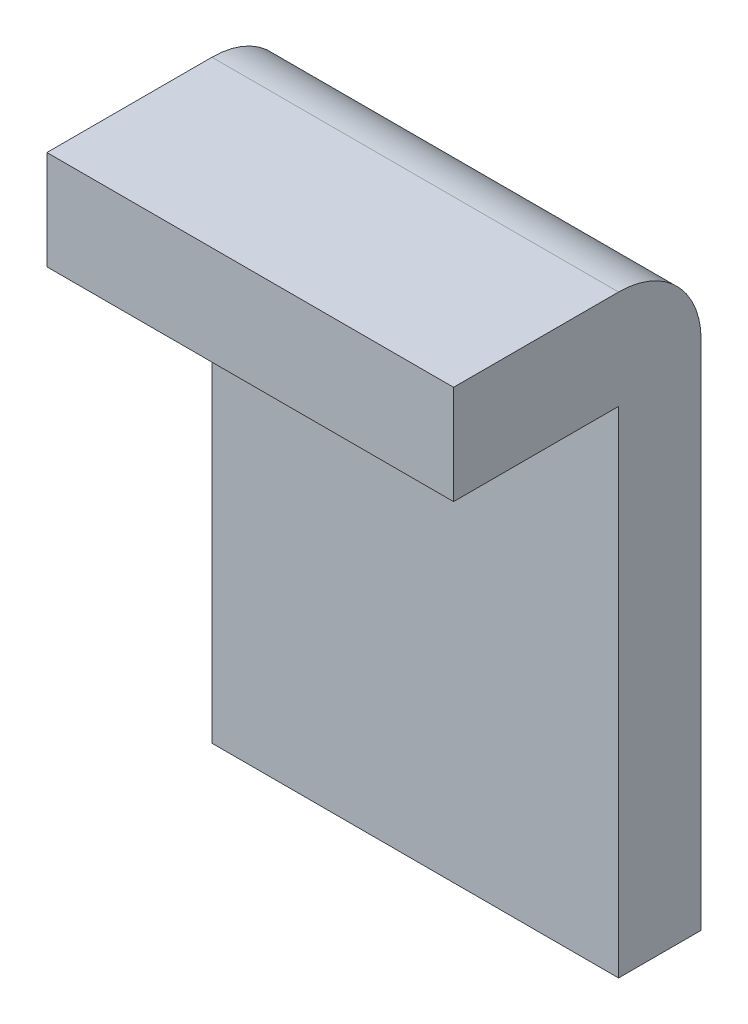
ISO-10303-21;
HEADER;
FILE_DESCRIPTION(('STEP AP214'),'2;1');
FILE_NAME('part.step','',(''),(''),'','','');
FILE_SCHEMA(('AUTOMOTIVE_DESIGN { 1 0 10303 214 1 1 1 1 }'));
ENDSEC;
DATA;
#1=APPLICATION_CONTEXT('core data for automotive mechanical design processes');
#2=APPLICATION_PROTOCOL_DEFINITION('international standard','automotive_design',2000,#1);
#3=PRODUCT_CONTEXT('',#1,'mechanical');
#4=PRODUCT('Part','Part','',(#3));
#5=PRODUCT_RELATED_PRODUCT_CATEGORY('part','',(#4));
#6=PRODUCT_DEFINITION_FORMATION('','',#4);
#7=PRODUCT_DEFINITION_CONTEXT('part definition',#1,'design');
#8=PRODUCT_DEFINITION('design','',#6,#7);
#9=PRODUCT_DEFINITION_SHAPE('','',#8);
#10=(LENGTH_UNIT() NAMED_UNIT(*) SI_UNIT(.MILLI.,.METRE.));
#11=(NAMED_UNIT(*) PLANE_ANGLE_UNIT() SI_UNIT($,.RADIAN.));
#12=(NAMED_UNIT(*) SI_UNIT($,.STERADIAN.) SOLID_ANGLE_UNIT());
#13=UNCERTAINTY_MEASURE_WITH_UNIT(LENGTH_MEASURE(1.E-05),#10,'distance_accuracy_value','');
#14=(GEOMETRIC_REPRESENTATION_CONTEXT(3) GLOBAL_UNCERTAINTY_ASSIGNED_CONTEXT((#13)) GLOBAL_UNIT_ASSIGNED_CONTEXT((#10,
#11,#12)) REPRESENTATION_CONTEXT('',''));
#15=CARTESIAN_POINT('',(0.,0.,0.));
#16=DIRECTION('',(0.,0.,1.));
#17=DIRECTION('',(1.,0.,0.));
#18=AXIS2_PLACEMENT_3D('',#15,#16,#17);
#19=CARTESIAN_POINT('',(-8.34906661620967,8.30000000000001,4.25467377707551));
#20=DIRECTION('',(0.,1.,0.));
#21=DIRECTION('',(0.,0.,1.));
#22=AXIS2_PLACEMENT_3D('',#19,#20,#21);
#23=PLANE('',#22);
#24=DIRECTION('',(1.,0.,0.));
#25=VECTOR('',#24,1.);
#26=CARTESIAN_POINT('',(6.65467418628921,8.30000000000001,4.25467377707552));
#27=LINE('',#26,#25);
#28=CARTESIAN_POINT('',(6.65467418628921,8.30000000000001,4.25467377707551));
#29=VERTEX_POINT('',#28);
#30=CARTESIAN_POINT('',(7.88682494272993,8.30000000000001,4.25467377707551));
#31=VERTEX_POINT('',#30);
#32=EDGE_CURVE('E133',#29,#31,#27,.T.);
#33=ORIENTED_EDGE('',*,*,#32,.F.);
#34=DIRECTION('',(0.,0.,1.));
#35=VECTOR('',#34,1.);
#36=CARTESIAN_POINT('',(6.65467418628921,8.30000000000001,4.25467377707553));
#37=LINE('',#36,#35);
#38=CARTESIAN_POINT('',(6.65467418628921,8.30000000000001,3.75467377707551));
#39=VERTEX_POINT('',#38);
#40=EDGE_CURVE('E113',#39,#29,#37,.T.);
#41=ORIENTED_EDGE('',*,*,#40,.F.);
#42=DIRECTION('',(1.,0.,0.));
#43=VECTOR('',#42,1.);
#44=CARTESIAN_POINT('',(-8.34906661620967,8.30000000000001,3.75467377707551));
#45=LINE('',#44,#43);
#46=CARTESIAN_POINT('',(7.88682494272993,8.30000000000001,3.75467377707551));
#47=VERTEX_POINT('',#46);
#48=EDGE_CURVE('E130',#39,#47,#45,.T.);
#49=ORIENTED_EDGE('',*,*,#48,.T.);
#50=DIRECTION('',(0.,0.,-1.));
#51=VECTOR('',#50,1.);
#52=CARTESIAN_POINT('',(7.88682494272994,8.30000000000001,4.25467377707553));
#53=LINE('',#52,#51);
#54=EDGE_CURVE('E129',#31,#47,#53,.T.);
#55=ORIENTED_EDGE('',*,*,#54,.F.);
#56=EDGE_LOOP('',(#33,#41,#49,#55));
#57=FACE_BOUND('',#56,.T.);
#58=ADVANCED_FACE('F17',(#57),#23,.F.);
#59=CARTESIAN_POINT('',(6.65467418628921,5.35753839337144,4.25467377707553));
#60=DIRECTION('',(0.,0.,1.));
#61=DIRECTION('',(0.,-1.,0.));
#62=AXIS2_PLACEMENT_3D('',#59,#60,#61);
#63=PLANE('',#62);
#64=DIRECTION('',(1.,0.,0.));
#65=VECTOR('',#64,1.);
#66=CARTESIAN_POINT('',(-8.34906661620967,8.6,4.25467377707551));
#67=LINE('',#66,#65);
#68=CARTESIAN_POINT('',(7.88682494272993,8.6,4.25467377707551));
#69=VERTEX_POINT('',#68);
#70=CARTESIAN_POINT('',(6.65467418628921,8.6,4.25467377707551));
#71=VERTEX_POINT('',#70);
#72=EDGE_CURVE('E131',#69,#71,#67,.F.);
#73=ORIENTED_EDGE('',*,*,#72,.T.);
#74=DIRECTION('',(0.,1.,0.));
#75=VECTOR('',#74,1.);
#76=CARTESIAN_POINT('',(6.65467418628921,5.35753839337144,4.25467377707551));
#77=LINE('',#76,#75);
#78=EDGE_CURVE('E136',#29,#71,#77,.T.);
#79=ORIENTED_EDGE('',*,*,#78,.F.);
#80=ORIENTED_EDGE('',*,*,#32,.T.);
#81=DIRECTION('',(0.,1.,0.));
#82=VECTOR('',#81,1.);
#83=CARTESIAN_POINT('',(7.88682494272994,5.35753839337144,4.25467377707551));
#84=LINE('',#83,#82);
#85=EDGE_CURVE('E120',#69,#31,#84,.F.);
#86=ORIENTED_EDGE('',*,*,#85,.F.);
#87=EDGE_LOOP('',(#73,#79,#80,#86));
#88=FACE_BOUND('',#87,.T.);
#89=ADVANCED_FACE('F172',(#88),#63,.T.);
#90=CARTESIAN_POINT('',(-8.34906661620967,8.6,4.25467377707551));
#91=DIRECTION('',(0.,-1.,0.));
#92=DIRECTION('',(0.,0.,-1.));
#93=AXIS2_PLACEMENT_3D('',#90,#91,#92);
#94=PLANE('',#93);
#95=DIRECTION('',(1.,0.,0.));
#96=VECTOR('',#95,1.);
#97=CARTESIAN_POINT('',(-8.34906661620967,8.6,3.75467377707551));
#98=LINE('',#97,#96);
#99=CARTESIAN_POINT('',(6.65467418628921,8.6,3.7546737770755));
#100=VERTEX_POINT('',#99);
#101=CARTESIAN_POINT('',(7.88682494272993,8.6,3.7546737770755));
#102=VERTEX_POINT('',#101);
#103=EDGE_CURVE('E79',#100,#102,#98,.T.);
#104=ORIENTED_EDGE('',*,*,#103,.F.);
#105=DIRECTION('',(0.,0.,1.));
#106=VECTOR('',#105,1.);
#107=CARTESIAN_POINT('',(6.65467418628921,8.6,4.25467377707553));
#108=LINE('',#107,#106);
#109=EDGE_CURVE('E139',#71,#100,#108,.F.);
#110=ORIENTED_EDGE('',*,*,#109,.F.);
#111=ORIENTED_EDGE('',*,*,#72,.F.);
#112=DIRECTION('',(0.,0.,-1.));
#113=VECTOR('',#112,1.);
#114=CARTESIAN_POINT('',(7.88682494272994,8.6,4.25467377707553));
#115=LINE('',#114,#113);
#116=EDGE_CURVE('E83',#102,#69,#115,.F.);
#117=ORIENTED_EDGE('',*,*,#116,.F.);
#118=EDGE_LOOP('',(#104,#110,#111,#117));
#119=FACE_BOUND('',#118,.T.);
#120=ADVANCED_FACE('F169',(#119),#94,.F.);
#121=CARTESIAN_POINT('',(-8.34906661620967,8.30000000000001,3.75467377707551));
#122=DIRECTION('',(0.,0.,-1.));
#123=DIRECTION('',(0.,1.,0.));
#124=AXIS2_PLACEMENT_3D('',#121,#122,#123);
#125=PLANE('',#124);
#126=ORIENTED_EDGE('',*,*,#48,.F.);
#127=DIRECTION('',(0.,1.,0.));
#128=VECTOR('',#127,1.);
#129=CARTESIAN_POINT('',(6.65467418628921,5.35753839337144,3.75467377707551));
#130=LINE('',#129,#128);
#131=CARTESIAN_POINT('',(6.65467418628921,6.8,3.75467377707551));
#132=VERTEX_POINT('',#131);
#133=EDGE_CURVE('E95',#132,#39,#130,.T.);
#134=ORIENTED_EDGE('',*,*,#133,.F.);
#135=DIRECTION('',(1.,0.,0.));
#136=VECTOR('',#135,1.);
#137=CARTESIAN_POINT('',(-15.8147962412963,6.8,3.75467377707551));
#138=LINE('',#137,#136);
#139=CARTESIAN_POINT('',(7.88682494272994,6.8,3.75467377707551));
#140=VERTEX_POINT('',#139);
#141=EDGE_CURVE('E114',#140,#132,#138,.F.);
#142=ORIENTED_EDGE('',*,*,#141,.F.);
#143=DIRECTION('',(0.,1.,0.));
#144=VECTOR('',#143,1.);
#145=CARTESIAN_POINT('',(7.88682494272994,5.35753839337144,3.75467377707551));
#146=LINE('',#145,#144);
#147=EDGE_CURVE('E84',#47,#140,#146,.F.);
#148=ORIENTED_EDGE('',*,*,#147,.F.);
#149=EDGE_LOOP('',(#126,#134,#142,#148));
#150=FACE_BOUND('',#149,.T.);
#151=ADVANCED_FACE('F178',(#150),#125,.F.);
#152=CARTESIAN_POINT('',(-8.34906661620967,8.35,3.7546737770755));
#153=DIRECTION('',(1.,0.,0.));
#154=DIRECTION('',(0.,0.,-1.));
#155=AXIS2_PLACEMENT_3D('',#152,#153,#154);
#156=CYLINDRICAL_SURFACE('',#155,0.249999999999996);
#157=CARTESIAN_POINT('',(6.65467418628921,8.35,3.7546737770755));
#158=DIRECTION('',(1.,0.,0.));
#159=DIRECTION('',(0.,0.,-1.));
#160=AXIS2_PLACEMENT_3D('',#157,#158,#159);
#161=CIRCLE('',#160,0.249999999999996);
#162=CARTESIAN_POINT('',(6.65467418628921,8.35,3.50467377707551));
#163=VERTEX_POINT('',#162);
#164=EDGE_CURVE('E106',#100,#163,#161,.F.);
#165=ORIENTED_EDGE('',*,*,#164,.F.);
#166=ORIENTED_EDGE('',*,*,#103,.T.);
#167=CARTESIAN_POINT('',(7.88682494272993,8.35,3.7546737770755));
#168=DIRECTION('',(1.,0.,0.));
#169=DIRECTION('',(0.,0.,-1.));
#170=AXIS2_PLACEMENT_3D('',#167,#168,#169);
#171=CIRCLE('',#170,0.249999999999996);
#172=CARTESIAN_POINT('',(7.88682494272993,8.35,3.50467377707551));
#173=VERTEX_POINT('',#172);
#174=EDGE_CURVE('E20',#173,#102,#171,.T.);
#175=ORIENTED_EDGE('',*,*,#174,.F.);
#176=DIRECTION('',(1.,0.,0.));
#177=VECTOR('',#176,1.);
#178=CARTESIAN_POINT('',(6.65467418628921,8.35,3.50467377707551));
#179=LINE('',#178,#177);
#180=EDGE_CURVE('E77',#163,#173,#179,.T.);
#181=ORIENTED_EDGE('',*,*,#180,.F.);
#182=EDGE_LOOP('',(#165,#166,#175,#181));
#183=FACE_BOUND('',#182,.T.);
#184=ADVANCED_FACE('F75',(#183),#156,.T.);
#185=CARTESIAN_POINT('',(7.88682494272994,5.35753839337144,4.25467377707553));
#186=DIRECTION('',(1.,0.,0.));
#187=DIRECTION('',(0.,0.,-1.));
#188=AXIS2_PLACEMENT_3D('',#185,#186,#187);
#189=PLANE('',#188);
#190=ORIENTED_EDGE('',*,*,#116,.T.);
#191=ORIENTED_EDGE('',*,*,#85,.T.);
#192=ORIENTED_EDGE('',*,*,#54,.T.);
#193=ORIENTED_EDGE('',*,*,#147,.T.);
#194=DIRECTION('',(0.,0.,-1.));
#195=VECTOR('',#194,1.);
#196=CARTESIAN_POINT('',(7.88682494272994,6.80000000000003,12.5046737770755));
#197=LINE('',#196,#195);
#198=CARTESIAN_POINT('',(7.88682494272993,6.8,3.50467377707552));
#199=VERTEX_POINT('',#198);
#200=EDGE_CURVE('E90',#199,#140,#197,.F.);
#201=ORIENTED_EDGE('',*,*,#200,.F.);
#202=DIRECTION('',(0.,1.,0.));
#203=VECTOR('',#202,1.);
#204=CARTESIAN_POINT('',(7.88682494272992,5.35753839337143,3.50467377707553));
#205=LINE('',#204,#203);
#206=EDGE_CURVE('E86',#173,#199,#205,.F.);
#207=ORIENTED_EDGE('',*,*,#206,.F.);
#208=ORIENTED_EDGE('',*,*,#174,.T.);
#209=EDGE_LOOP('',(#190,#191,#192,#193,#201,#207,#208));
#210=FACE_BOUND('',#209,.T.);
#211=ADVANCED_FACE('F87',(#210),#189,.T.);
#212=CARTESIAN_POINT('',(-15.8147962412963,6.80000000000003,12.5046737770755));
#213=DIRECTION('',(0.,-1.,0.));
#214=DIRECTION('',(0.,0.,-1.));
#215=AXIS2_PLACEMENT_3D('',#212,#213,#214);
#216=PLANE('',#215);
#217=DIRECTION('',(1.,0.,0.));
#218=VECTOR('',#217,1.);
#219=CARTESIAN_POINT('',(6.65467418628921,6.8,3.50467377707552));
#220=LINE('',#219,#218);
#221=CARTESIAN_POINT('',(6.65467418628921,6.8,3.50467377707552));
#222=VERTEX_POINT('',#221);
#223=EDGE_CURVE('E26',#199,#222,#220,.F.);
#224=ORIENTED_EDGE('',*,*,#223,.F.);
#225=ORIENTED_EDGE('',*,*,#200,.T.);
#226=ORIENTED_EDGE('',*,*,#141,.T.);
#227=DIRECTION('',(0.,0.,1.));
#228=VECTOR('',#227,1.);
#229=CARTESIAN_POINT('',(6.65467418628921,6.8,4.25467377707553));
#230=LINE('',#229,#228);
#231=EDGE_CURVE('E35',#222,#132,#230,.T.);
#232=ORIENTED_EDGE('',*,*,#231,.F.);
#233=EDGE_LOOP('',(#224,#225,#226,#232));
#234=FACE_BOUND('',#233,.T.);
#235=ADVANCED_FACE('F179',(#234),#216,.T.);
#236=CARTESIAN_POINT('',(6.65467418628921,5.35753839337144,4.25467377707553));
#237=DIRECTION('',(-1.,0.,0.));
#238=DIRECTION('',(0.,0.,1.));
#239=AXIS2_PLACEMENT_3D('',#236,#237,#238);
#240=PLANE('',#239);
#241=ORIENTED_EDGE('',*,*,#231,.T.);
#242=ORIENTED_EDGE('',*,*,#133,.T.);
#243=ORIENTED_EDGE('',*,*,#40,.T.);
#244=ORIENTED_EDGE('',*,*,#78,.T.);
#245=ORIENTED_EDGE('',*,*,#109,.T.);
#246=ORIENTED_EDGE('',*,*,#164,.T.);
#247=DIRECTION('',(0.,1.,0.));
#248=VECTOR('',#247,1.);
#249=CARTESIAN_POINT('',(6.65467418628921,5.35753839337143,3.50467377707553));
#250=LINE('',#249,#248);
#251=EDGE_CURVE('E11',#222,#163,#250,.T.);
#252=ORIENTED_EDGE('',*,*,#251,.F.);
#253=EDGE_LOOP('',(#241,#242,#243,#244,#245,#246,#252));
#254=FACE_BOUND('',#253,.T.);
#255=ADVANCED_FACE('F166',(#254),#240,.T.);
#256=CARTESIAN_POINT('',(6.65467418628921,5.35753839337143,3.50467377707553));
#257=DIRECTION('',(0.,0.,-1.));
#258=DIRECTION('',(0.,1.,0.));
#259=AXIS2_PLACEMENT_3D('',#256,#257,#258);
#260=PLANE('',#259);
#261=ORIENTED_EDGE('',*,*,#223,.T.);
#262=ORIENTED_EDGE('',*,*,#251,.T.);
#263=ORIENTED_EDGE('',*,*,#180,.T.);
#264=ORIENTED_EDGE('',*,*,#206,.T.);
#265=EDGE_LOOP('',(#261,#262,#263,#264));
#266=FACE_BOUND('',#265,.T.);
#267=ADVANCED_FACE('F94',(#266),#260,.T.);
#268=CLOSED_SHELL('',(#58,#89,#120,#151,#184,#211,#235,#255,#267));
#269=MANIFOLD_SOLID_BREP('B1',#268);
#270=ADVANCED_BREP_SHAPE_REPRESENTATION('',(#18,#269),#14);
#271=SHAPE_DEFINITION_REPRESENTATION(#9,#270);
ENDSEC;
END-ISO-10303-21;
